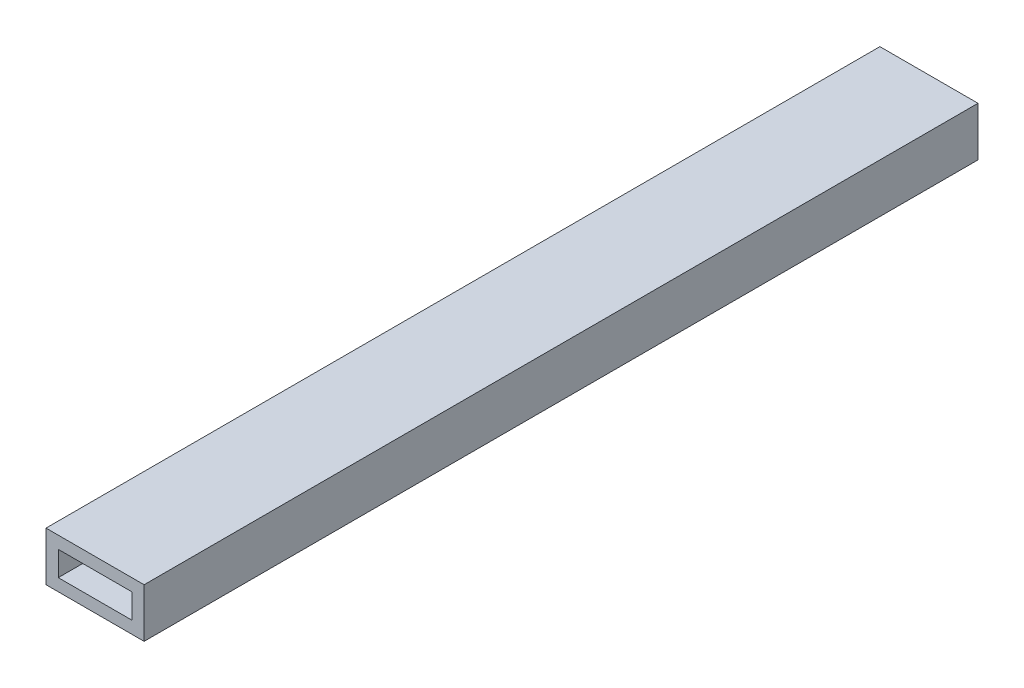
ISO-10303-21;
HEADER;
FILE_DESCRIPTION(('STEP AP214'),'2;1');
FILE_NAME('part.step','',(''),(''),'','','');
FILE_SCHEMA(('AUTOMOTIVE_DESIGN { 1 0 10303 214 1 1 1 1 }'));
ENDSEC;
DATA;
#1=APPLICATION_CONTEXT('core data for automotive mechanical design processes');
#2=APPLICATION_PROTOCOL_DEFINITION('international standard','automotive_design',2000,#1);
#3=PRODUCT_CONTEXT('',#1,'mechanical');
#4=PRODUCT('Part','Part','',(#3));
#5=PRODUCT_RELATED_PRODUCT_CATEGORY('part','',(#4));
#6=PRODUCT_DEFINITION_FORMATION('','',#4);
#7=PRODUCT_DEFINITION_CONTEXT('part definition',#1,'design');
#8=PRODUCT_DEFINITION('design','',#6,#7);
#9=PRODUCT_DEFINITION_SHAPE('','',#8);
#10=(LENGTH_UNIT() NAMED_UNIT(*) SI_UNIT(.MILLI.,.METRE.));
#11=(NAMED_UNIT(*) PLANE_ANGLE_UNIT() SI_UNIT($,.RADIAN.));
#12=(NAMED_UNIT(*) SI_UNIT($,.STERADIAN.) SOLID_ANGLE_UNIT());
#13=UNCERTAINTY_MEASURE_WITH_UNIT(LENGTH_MEASURE(1.E-05),#10,'distance_accuracy_value','');
#14=(GEOMETRIC_REPRESENTATION_CONTEXT(3) GLOBAL_UNCERTAINTY_ASSIGNED_CONTEXT((#13)) GLOBAL_UNIT_ASSIGNED_CONTEXT((#10,
#11,#12)) REPRESENTATION_CONTEXT('',''));
#15=CARTESIAN_POINT('',(0.,0.,0.));
#16=DIRECTION('',(0.,0.,1.));
#17=DIRECTION('',(1.,0.,0.));
#18=AXIS2_PLACEMENT_3D('',#15,#16,#17);
#19=CARTESIAN_POINT('',(-10.4247557003257,8.06677524429967,215.9));
#20=DIRECTION('',(1.,0.,0.));
#21=DIRECTION('',(0.,1.,0.));
#22=AXIS2_PLACEMENT_3D('',#19,#20,#21);
#23=PLANE('',#22);
#24=DIRECTION('',(0.,-1.,0.));
#25=VECTOR('',#24,1.);
#26=CARTESIAN_POINT('',(-10.4247557003257,8.06677524429967,0.));
#27=LINE('',#26,#25);
#28=CARTESIAN_POINT('',(-10.4247557003257,8.06677524429967,0.));
#29=VERTEX_POINT('',#28);
#30=CARTESIAN_POINT('',(-10.4247557003257,-4.63322475570033,0.));
#31=VERTEX_POINT('',#30);
#32=EDGE_CURVE('E130',#29,#31,#27,.T.);
#33=ORIENTED_EDGE('',*,*,#32,.T.);
#34=DIRECTION('',(0.,0.,-1.));
#35=VECTOR('',#34,1.);
#36=CARTESIAN_POINT('',(-10.4247557003257,-4.63322475570033,215.9));
#37=LINE('',#36,#35);
#38=CARTESIAN_POINT('',(-10.4247557003257,-4.63322475570033,215.9));
#39=VERTEX_POINT('',#38);
#40=EDGE_CURVE('E11',#39,#31,#37,.T.);
#41=ORIENTED_EDGE('',*,*,#40,.F.);
#42=DIRECTION('',(0.,-1.,0.));
#43=VECTOR('',#42,1.);
#44=CARTESIAN_POINT('',(-10.4247557003257,8.06677524429967,215.9));
#45=LINE('',#44,#43);
#46=CARTESIAN_POINT('',(-10.4247557003257,8.06677524429967,215.9));
#47=VERTEX_POINT('',#46);
#48=EDGE_CURVE('E134',#47,#39,#45,.T.);
#49=ORIENTED_EDGE('',*,*,#48,.F.);
#50=DIRECTION('',(0.,0.,-1.));
#51=VECTOR('',#50,1.);
#52=CARTESIAN_POINT('',(-10.4247557003257,8.06677524429967,215.9));
#53=LINE('',#52,#51);
#54=EDGE_CURVE('E146',#47,#29,#53,.T.);
#55=ORIENTED_EDGE('',*,*,#54,.T.);
#56=EDGE_LOOP('',(#33,#41,#49,#55));
#57=FACE_BOUND('',#56,.T.);
#58=ADVANCED_FACE('F33',(#57),#23,.F.);
#59=CARTESIAN_POINT('',(-10.4247557003257,-4.63322475570033,215.9));
#60=DIRECTION('',(0.,1.,0.));
#61=DIRECTION('',(0.,0.,1.));
#62=AXIS2_PLACEMENT_3D('',#59,#60,#61);
#63=PLANE('',#62);
#64=DIRECTION('',(1.,0.,0.));
#65=VECTOR('',#64,1.);
#66=CARTESIAN_POINT('',(-10.4247557003257,-4.63322475570033,0.));
#67=LINE('',#66,#65);
#68=CARTESIAN_POINT('',(14.9752442996743,-4.63322475570033,0.));
#69=VERTEX_POINT('',#68);
#70=EDGE_CURVE('E149',#31,#69,#67,.T.);
#71=ORIENTED_EDGE('',*,*,#70,.T.);
#72=DIRECTION('',(0.,0.,-1.));
#73=VECTOR('',#72,1.);
#74=CARTESIAN_POINT('',(14.9752442996743,-4.63322475570033,215.9));
#75=LINE('',#74,#73);
#76=CARTESIAN_POINT('',(14.9752442996743,-4.63322475570033,215.9));
#77=VERTEX_POINT('',#76);
#78=EDGE_CURVE('E40',#77,#69,#75,.T.);
#79=ORIENTED_EDGE('',*,*,#78,.F.);
#80=DIRECTION('',(1.,0.,0.));
#81=VECTOR('',#80,1.);
#82=CARTESIAN_POINT('',(-10.4247557003257,-4.63322475570033,215.9));
#83=LINE('',#82,#81);
#84=EDGE_CURVE('E137',#39,#77,#83,.T.);
#85=ORIENTED_EDGE('',*,*,#84,.F.);
#86=ORIENTED_EDGE('',*,*,#40,.T.);
#87=EDGE_LOOP('',(#71,#79,#85,#86));
#88=FACE_BOUND('',#87,.T.);
#89=ADVANCED_FACE('F165',(#88),#63,.F.);
#90=CARTESIAN_POINT('',(14.9752442996743,8.06677524429967,215.9));
#91=DIRECTION('',(1.,0.,0.));
#92=DIRECTION('',(0.,1.,0.));
#93=AXIS2_PLACEMENT_3D('',#90,#91,#92);
#94=PLANE('',#93);
#95=DIRECTION('',(0.,-1.,0.));
#96=VECTOR('',#95,1.);
#97=CARTESIAN_POINT('',(14.9752442996743,8.06677524429967,0.));
#98=LINE('',#97,#96);
#99=CARTESIAN_POINT('',(14.9752442996743,8.06677524429967,0.));
#100=VERTEX_POINT('',#99);
#101=EDGE_CURVE('E152',#100,#69,#98,.T.);
#102=ORIENTED_EDGE('',*,*,#101,.F.);
#103=DIRECTION('',(0.,0.,-1.));
#104=VECTOR('',#103,1.);
#105=CARTESIAN_POINT('',(14.9752442996743,8.06677524429967,215.9));
#106=LINE('',#105,#104);
#107=CARTESIAN_POINT('',(14.9752442996743,8.06677524429967,215.9));
#108=VERTEX_POINT('',#107);
#109=EDGE_CURVE('E158',#108,#100,#106,.T.);
#110=ORIENTED_EDGE('',*,*,#109,.F.);
#111=DIRECTION('',(0.,-1.,0.));
#112=VECTOR('',#111,1.);
#113=CARTESIAN_POINT('',(14.9752442996743,8.06677524429967,215.9));
#114=LINE('',#113,#112);
#115=EDGE_CURVE('E140',#108,#77,#114,.T.);
#116=ORIENTED_EDGE('',*,*,#115,.T.);
#117=ORIENTED_EDGE('',*,*,#78,.T.);
#118=EDGE_LOOP('',(#102,#110,#116,#117));
#119=FACE_BOUND('',#118,.T.);
#120=ADVANCED_FACE('F162',(#119),#94,.T.);
#121=CARTESIAN_POINT('',(-10.4247557003257,8.06677524429967,215.9));
#122=DIRECTION('',(0.,1.,0.));
#123=DIRECTION('',(0.,0.,1.));
#124=AXIS2_PLACEMENT_3D('',#121,#122,#123);
#125=PLANE('',#124);
#126=DIRECTION('',(1.,0.,0.));
#127=VECTOR('',#126,1.);
#128=CARTESIAN_POINT('',(-10.4247557003257,8.06677524429967,0.));
#129=LINE('',#128,#127);
#130=EDGE_CURVE('E138',#29,#100,#129,.T.);
#131=ORIENTED_EDGE('',*,*,#130,.F.);
#132=ORIENTED_EDGE('',*,*,#54,.F.);
#133=DIRECTION('',(1.,0.,0.));
#134=VECTOR('',#133,1.);
#135=CARTESIAN_POINT('',(-10.4247557003257,8.06677524429967,215.9));
#136=LINE('',#135,#134);
#137=EDGE_CURVE('E143',#47,#108,#136,.T.);
#138=ORIENTED_EDGE('',*,*,#137,.T.);
#139=ORIENTED_EDGE('',*,*,#109,.T.);
#140=EDGE_LOOP('',(#131,#132,#138,#139));
#141=FACE_BOUND('',#140,.T.);
#142=ADVANCED_FACE('F172',(#141),#125,.T.);
#143=CARTESIAN_POINT('',(0.,0.,215.9));
#144=DIRECTION('',(0.,0.,1.));
#145=DIRECTION('',(1.,0.,0.));
#146=AXIS2_PLACEMENT_3D('',#143,#144,#145);
#147=PLANE('',#146);
#148=DIRECTION('',(-1.,0.,0.));
#149=VECTOR('',#148,1.);
#150=CARTESIAN_POINT('',(11.8002442996743,-1.45822475570033,215.9));
#151=LINE('',#150,#149);
#152=CARTESIAN_POINT('',(11.8002442996743,-1.45822475570033,215.9));
#153=VERTEX_POINT('',#152);
#154=CARTESIAN_POINT('',(-7.24975570032574,-1.45822475570033,215.9));
#155=VERTEX_POINT('',#154);
#156=EDGE_CURVE('E99',#153,#155,#151,.T.);
#157=ORIENTED_EDGE('',*,*,#156,.T.);
#158=DIRECTION('',(0.,1.,0.));
#159=VECTOR('',#158,1.);
#160=CARTESIAN_POINT('',(-7.24975570032574,-1.45822475570033,215.9));
#161=LINE('',#160,#159);
#162=CARTESIAN_POINT('',(-7.24975570032574,4.89177524429967,215.9));
#163=VERTEX_POINT('',#162);
#164=EDGE_CURVE('E108',#155,#163,#161,.T.);
#165=ORIENTED_EDGE('',*,*,#164,.T.);
#166=DIRECTION('',(1.,0.,0.));
#167=VECTOR('',#166,1.);
#168=CARTESIAN_POINT('',(-7.24975570032574,4.89177524429967,215.9));
#169=LINE('',#168,#167);
#170=CARTESIAN_POINT('',(11.8002442996743,4.89177524429967,215.9));
#171=VERTEX_POINT('',#170);
#172=EDGE_CURVE('E47',#163,#171,#169,.T.);
#173=ORIENTED_EDGE('',*,*,#172,.T.);
#174=DIRECTION('',(0.,-1.,0.));
#175=VECTOR('',#174,1.);
#176=CARTESIAN_POINT('',(11.8002442996743,4.89177524429967,215.9));
#177=LINE('',#176,#175);
#178=EDGE_CURVE('E105',#171,#153,#177,.T.);
#179=ORIENTED_EDGE('',*,*,#178,.T.);
#180=EDGE_LOOP('',(#157,#165,#173,#179));
#181=FACE_BOUND('',#180,.T.);
#182=ORIENTED_EDGE('',*,*,#48,.T.);
#183=ORIENTED_EDGE('',*,*,#84,.T.);
#184=ORIENTED_EDGE('',*,*,#115,.F.);
#185=ORIENTED_EDGE('',*,*,#137,.F.);
#186=EDGE_LOOP('',(#182,#183,#184,#185));
#187=FACE_BOUND('',#186,.T.);
#188=ADVANCED_FACE('F112',(#181,#187),#147,.T.);
#189=CARTESIAN_POINT('',(0.,0.,0.));
#190=DIRECTION('',(0.,0.,1.));
#191=DIRECTION('',(1.,0.,0.));
#192=AXIS2_PLACEMENT_3D('',#189,#190,#191);
#193=PLANE('',#192);
#194=DIRECTION('',(0.,1.,0.));
#195=VECTOR('',#194,1.);
#196=CARTESIAN_POINT('',(-7.24975570032574,-1.45822475570033,0.));
#197=LINE('',#196,#195);
#198=CARTESIAN_POINT('',(-7.24975570032574,-1.45822475570033,0.));
#199=VERTEX_POINT('',#198);
#200=CARTESIAN_POINT('',(-7.24975570032574,4.89177524429967,0.));
#201=VERTEX_POINT('',#200);
#202=EDGE_CURVE('E124',#199,#201,#197,.T.);
#203=ORIENTED_EDGE('',*,*,#202,.F.);
#204=DIRECTION('',(-1.,0.,0.));
#205=VECTOR('',#204,1.);
#206=CARTESIAN_POINT('',(11.8002442996743,-1.45822475570033,0.));
#207=LINE('',#206,#205);
#208=CARTESIAN_POINT('',(11.8002442996743,-1.45822475570033,0.));
#209=VERTEX_POINT('',#208);
#210=EDGE_CURVE('E55',#209,#199,#207,.T.);
#211=ORIENTED_EDGE('',*,*,#210,.F.);
#212=DIRECTION('',(0.,-1.,0.));
#213=VECTOR('',#212,1.);
#214=CARTESIAN_POINT('',(11.8002442996743,4.89177524429967,0.));
#215=LINE('',#214,#213);
#216=CARTESIAN_POINT('',(11.8002442996743,4.89177524429967,0.));
#217=VERTEX_POINT('',#216);
#218=EDGE_CURVE('E115',#217,#209,#215,.T.);
#219=ORIENTED_EDGE('',*,*,#218,.F.);
#220=DIRECTION('',(1.,0.,0.));
#221=VECTOR('',#220,1.);
#222=CARTESIAN_POINT('',(-7.24975570032574,4.89177524429967,0.));
#223=LINE('',#222,#221);
#224=EDGE_CURVE('E118',#201,#217,#223,.T.);
#225=ORIENTED_EDGE('',*,*,#224,.F.);
#226=EDGE_LOOP('',(#203,#211,#219,#225));
#227=FACE_BOUND('',#226,.T.);
#228=ORIENTED_EDGE('',*,*,#32,.F.);
#229=ORIENTED_EDGE('',*,*,#130,.T.);
#230=ORIENTED_EDGE('',*,*,#101,.T.);
#231=ORIENTED_EDGE('',*,*,#70,.F.);
#232=EDGE_LOOP('',(#228,#229,#230,#231));
#233=FACE_BOUND('',#232,.T.);
#234=ADVANCED_FACE('F169',(#227,#233),#193,.F.);
#235=CARTESIAN_POINT('',(11.8002442996743,-1.45822475570033,215.9));
#236=DIRECTION('',(0.,-1.,0.));
#237=DIRECTION('',(0.,0.,-1.));
#238=AXIS2_PLACEMENT_3D('',#235,#236,#237);
#239=PLANE('',#238);
#240=ORIENTED_EDGE('',*,*,#210,.T.);
#241=DIRECTION('',(0.,0.,-1.));
#242=VECTOR('',#241,1.);
#243=CARTESIAN_POINT('',(-7.24975570032574,-1.45822475570033,215.9));
#244=LINE('',#243,#242);
#245=EDGE_CURVE('E95',#155,#199,#244,.T.);
#246=ORIENTED_EDGE('',*,*,#245,.F.);
#247=ORIENTED_EDGE('',*,*,#156,.F.);
#248=DIRECTION('',(0.,0.,-1.));
#249=VECTOR('',#248,1.);
#250=CARTESIAN_POINT('',(11.8002442996743,-1.45822475570033,215.9));
#251=LINE('',#250,#249);
#252=EDGE_CURVE('E128',#153,#209,#251,.T.);
#253=ORIENTED_EDGE('',*,*,#252,.T.);
#254=EDGE_LOOP('',(#240,#246,#247,#253));
#255=FACE_BOUND('',#254,.T.);
#256=ADVANCED_FACE('F97',(#255),#239,.F.);
#257=CARTESIAN_POINT('',(11.8002442996743,4.89177524429967,215.9));
#258=DIRECTION('',(1.,0.,0.));
#259=DIRECTION('',(0.,1.,0.));
#260=AXIS2_PLACEMENT_3D('',#257,#258,#259);
#261=PLANE('',#260);
#262=ORIENTED_EDGE('',*,*,#218,.T.);
#263=ORIENTED_EDGE('',*,*,#252,.F.);
#264=ORIENTED_EDGE('',*,*,#178,.F.);
#265=DIRECTION('',(0.,0.,-1.));
#266=VECTOR('',#265,1.);
#267=CARTESIAN_POINT('',(11.8002442996743,4.89177524429967,215.9));
#268=LINE('',#267,#266);
#269=EDGE_CURVE('E131',#171,#217,#268,.T.);
#270=ORIENTED_EDGE('',*,*,#269,.T.);
#271=EDGE_LOOP('',(#262,#263,#264,#270));
#272=FACE_BOUND('',#271,.T.);
#273=ADVANCED_FACE('F194',(#272),#261,.F.);
#274=CARTESIAN_POINT('',(-7.24975570032574,4.89177524429967,215.9));
#275=DIRECTION('',(0.,1.,0.));
#276=DIRECTION('',(0.,0.,1.));
#277=AXIS2_PLACEMENT_3D('',#274,#275,#276);
#278=PLANE('',#277);
#279=ORIENTED_EDGE('',*,*,#224,.T.);
#280=ORIENTED_EDGE('',*,*,#269,.F.);
#281=ORIENTED_EDGE('',*,*,#172,.F.);
#282=DIRECTION('',(0.,0.,-1.));
#283=VECTOR('',#282,1.);
#284=CARTESIAN_POINT('',(-7.24975570032574,4.89177524429967,215.9));
#285=LINE('',#284,#283);
#286=EDGE_CURVE('E104',#163,#201,#285,.T.);
#287=ORIENTED_EDGE('',*,*,#286,.T.);
#288=EDGE_LOOP('',(#279,#280,#281,#287));
#289=FACE_BOUND('',#288,.T.);
#290=ADVANCED_FACE('F197',(#289),#278,.F.);
#291=CARTESIAN_POINT('',(-7.24975570032574,-1.45822475570033,215.9));
#292=DIRECTION('',(-1.,0.,0.));
#293=DIRECTION('',(0.,0.,1.));
#294=AXIS2_PLACEMENT_3D('',#291,#292,#293);
#295=PLANE('',#294);
#296=ORIENTED_EDGE('',*,*,#202,.T.);
#297=ORIENTED_EDGE('',*,*,#286,.F.);
#298=ORIENTED_EDGE('',*,*,#164,.F.);
#299=ORIENTED_EDGE('',*,*,#245,.T.);
#300=EDGE_LOOP('',(#296,#297,#298,#299));
#301=FACE_BOUND('',#300,.T.);
#302=ADVANCED_FACE('F109',(#301),#295,.F.);
#303=CLOSED_SHELL('',(#58,#89,#120,#142,#188,#234,#256,#273,#290,#302));
#304=MANIFOLD_SOLID_BREP('B2',#303);
#305=ADVANCED_BREP_SHAPE_REPRESENTATION('',(#18,#304),#14);
#306=SHAPE_DEFINITION_REPRESENTATION(#9,#305);
ENDSEC;
END-ISO-10303-21;
